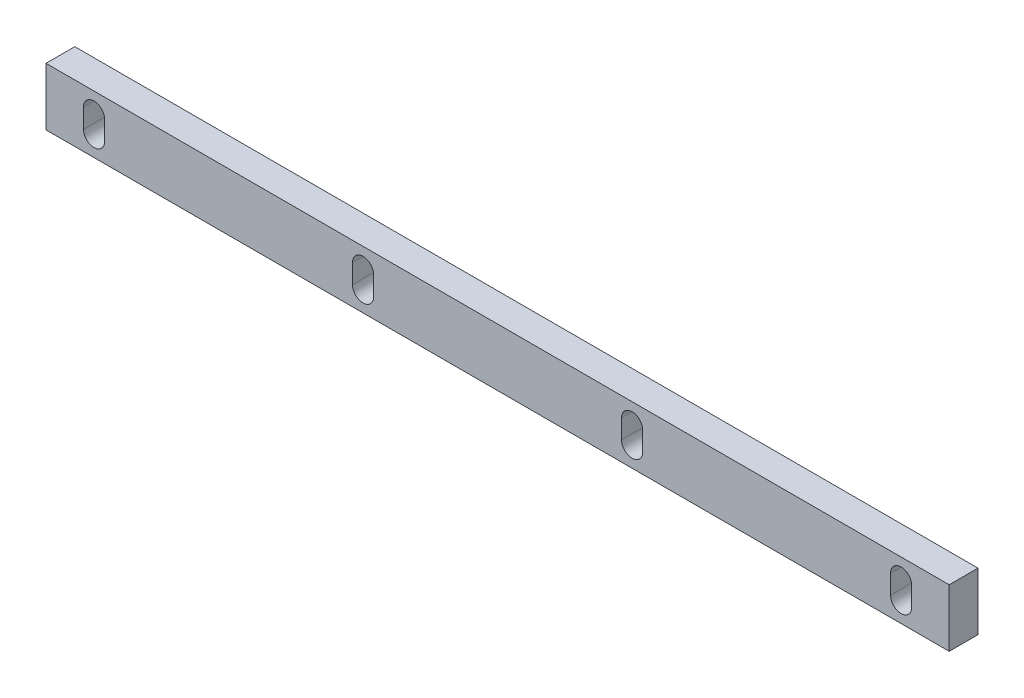
ISO-10303-21;
HEADER;
FILE_DESCRIPTION(('STEP AP214'),'2;1');
FILE_NAME('part.step','',(''),(''),'','','');
FILE_SCHEMA(('AUTOMOTIVE_DESIGN { 1 0 10303 214 1 1 1 1 }'));
ENDSEC;
DATA;
#1=APPLICATION_CONTEXT('core data for automotive mechanical design processes');
#2=APPLICATION_PROTOCOL_DEFINITION('international standard','automotive_design',2000,#1);
#3=PRODUCT_CONTEXT('',#1,'mechanical');
#4=PRODUCT('Part','Part','',(#3));
#5=PRODUCT_RELATED_PRODUCT_CATEGORY('part','',(#4));
#6=PRODUCT_DEFINITION_FORMATION('','',#4);
#7=PRODUCT_DEFINITION_CONTEXT('part definition',#1,'design');
#8=PRODUCT_DEFINITION('design','',#6,#7);
#9=PRODUCT_DEFINITION_SHAPE('','',#8);
#10=(LENGTH_UNIT() NAMED_UNIT(*) SI_UNIT(.MILLI.,.METRE.));
#11=(NAMED_UNIT(*) PLANE_ANGLE_UNIT() SI_UNIT($,.RADIAN.));
#12=(NAMED_UNIT(*) SI_UNIT($,.STERADIAN.) SOLID_ANGLE_UNIT());
#13=UNCERTAINTY_MEASURE_WITH_UNIT(LENGTH_MEASURE(1.E-05),#10,'distance_accuracy_value','');
#14=(GEOMETRIC_REPRESENTATION_CONTEXT(3) GLOBAL_UNCERTAINTY_ASSIGNED_CONTEXT((#13)) GLOBAL_UNIT_ASSIGNED_CONTEXT((#10,
#11,#12)) REPRESENTATION_CONTEXT('',''));
#15=CARTESIAN_POINT('',(0.,0.,0.));
#16=DIRECTION('',(0.,0.,1.));
#17=DIRECTION('',(1.,0.,0.));
#18=AXIS2_PLACEMENT_3D('',#15,#16,#17);
#19=CARTESIAN_POINT('',(235.,-14.9999999999949,7.49999999999917));
#20=DIRECTION('',(0.,1.00000000000003,0.));
#21=DIRECTION('',(0.,0.,1.00000000000003));
#22=AXIS2_PLACEMENT_3D('',#19,#20,#21);
#23=PLANE('',#22);
#24=DIRECTION('',(0.,0.,-1.00000000000003));
#25=VECTOR('',#24,1.);
#26=CARTESIAN_POINT('',(-235.000000000001,-14.9999999999925,7.49999999999906));
#27=LINE('',#26,#25);
#28=CARTESIAN_POINT('',(-235.000000000001,-14.9999999999925,7.49999999999906));
#29=VERTEX_POINT('',#28);
#30=CARTESIAN_POINT('',(-235.,-14.9999999999946,-7.50000000000128));
#31=VERTEX_POINT('',#30);
#32=EDGE_CURVE('E264',#29,#31,#27,.T.);
#33=ORIENTED_EDGE('',*,*,#32,.T.);
#34=DIRECTION('',(-1.,0.,0.));
#35=VECTOR('',#34,1.);
#36=CARTESIAN_POINT('',(235.,-14.9999999999947,-7.50000000000151));
#37=LINE('',#36,#35);
#38=CARTESIAN_POINT('',(235.,-14.9999999999947,-7.50000000000151));
#39=VERTEX_POINT('',#38);
#40=EDGE_CURVE('E291',#39,#31,#37,.T.);
#41=ORIENTED_EDGE('',*,*,#40,.F.);
#42=DIRECTION('',(0.,0.,-1.00000000000003));
#43=VECTOR('',#42,1.);
#44=CARTESIAN_POINT('',(235.,-14.9999999999949,7.49999999999917));
#45=LINE('',#44,#43);
#46=CARTESIAN_POINT('',(235.,-14.9999999999949,7.49999999999917));
#47=VERTEX_POINT('',#46);
#48=EDGE_CURVE('E265',#47,#39,#45,.T.);
#49=ORIENTED_EDGE('',*,*,#48,.F.);
#50=DIRECTION('',(-1.,0.,0.));
#51=VECTOR('',#50,1.);
#52=CARTESIAN_POINT('',(235.,-14.9999999999949,7.49999999999917));
#53=LINE('',#52,#51);
#54=EDGE_CURVE('E275',#47,#29,#53,.T.);
#55=ORIENTED_EDGE('',*,*,#54,.T.);
#56=EDGE_LOOP('',(#33,#41,#49,#55));
#57=FACE_BOUND('',#56,.T.);
#58=ADVANCED_FACE('F52',(#57),#23,.F.);
#59=CARTESIAN_POINT('',(235.,-14.9999999999947,-7.50000000000151));
#60=DIRECTION('',(0.,0.,1.00000000000003));
#61=DIRECTION('',(1.,0.,0.));
#62=AXIS2_PLACEMENT_3D('',#59,#60,#61);
#63=PLANE('',#62);
#64=DIRECTION('',(0.,-1.00000000000003,0.));
#65=VECTOR('',#64,1.);
#66=CARTESIAN_POINT('',(-75.5000000000019,-14.9999999999992,-7.50000000000028));
#67=LINE('',#66,#65);
#68=CARTESIAN_POINT('',(-75.5000000000019,5.00000000000322,-7.50000000000073));
#69=VERTEX_POINT('',#68);
#70=CARTESIAN_POINT('',(-75.5000000000019,-4.99999999999867,-7.49999999999917));
#71=VERTEX_POINT('',#70);
#72=EDGE_CURVE('E224',#69,#71,#67,.T.);
#73=ORIENTED_EDGE('',*,*,#72,.T.);
#74=CARTESIAN_POINT('',(-70.0000000000019,-4.99999999999878,-7.49999999999951));
#75=DIRECTION('',(0.,0.,1.00000000000003));
#76=DIRECTION('',(1.,0.,0.));
#77=AXIS2_PLACEMENT_3D('',#74,#75,#76);
#78=CIRCLE('',#77,5.50000000000001);
#79=CARTESIAN_POINT('',(-64.500000000002,-4.99999999999945,-7.49999999999995));
#80=VERTEX_POINT('',#79);
#81=EDGE_CURVE('E229',#71,#80,#78,.T.);
#82=ORIENTED_EDGE('',*,*,#81,.T.);
#83=DIRECTION('',(0.,1.00000000000003,0.));
#84=VECTOR('',#83,1.);
#85=CARTESIAN_POINT('',(-64.5000000000019,-14.9999999999993,-7.50000000000051));
#86=LINE('',#85,#84);
#87=CARTESIAN_POINT('',(-64.5000000000019,5.000000000003,-7.50000000000095));
#88=VERTEX_POINT('',#87);
#89=EDGE_CURVE('E201',#80,#88,#86,.T.);
#90=ORIENTED_EDGE('',*,*,#89,.T.);
#91=CARTESIAN_POINT('',(-70.0000000000019,5.00000000000278,-7.50000000000084));
#92=DIRECTION('',(0.,0.,1.00000000000003));
#93=DIRECTION('',(1.,0.,0.));
#94=AXIS2_PLACEMENT_3D('',#91,#92,#93);
#95=CIRCLE('',#94,5.50000000000001);
#96=EDGE_CURVE('E208',#88,#69,#95,.T.);
#97=ORIENTED_EDGE('',*,*,#96,.T.);
#98=EDGE_LOOP('',(#73,#82,#90,#97));
#99=FACE_BOUND('',#98,.T.);
#100=DIRECTION('',(0.,-1.00000000000003,0.));
#101=VECTOR('',#100,1.);
#102=CARTESIAN_POINT('',(-215.5,-14.9999999999945,-7.50000000000106));
#103=LINE('',#102,#101);
#104=CARTESIAN_POINT('',(-215.5,5.00000000001055,-7.50000000000106));
#105=VERTEX_POINT('',#104);
#106=CARTESIAN_POINT('',(-215.5,-4.99999999999368,-7.50000000000062));
#107=VERTEX_POINT('',#106);
#108=EDGE_CURVE('E258',#105,#107,#103,.T.);
#109=ORIENTED_EDGE('',*,*,#108,.T.);
#110=CARTESIAN_POINT('',(-210.,-4.99999999999379,-7.50000000000017));
#111=DIRECTION('',(0.,0.,1.00000000000003));
#112=DIRECTION('',(1.,0.,0.));
#113=AXIS2_PLACEMENT_3D('',#110,#111,#112);
#114=CIRCLE('',#113,5.50000000000001);
#115=CARTESIAN_POINT('',(-204.5,-4.99999999999345,-7.50000000000062));
#116=VERTEX_POINT('',#115);
#117=EDGE_CURVE('E261',#107,#116,#114,.T.);
#118=ORIENTED_EDGE('',*,*,#117,.T.);
#119=DIRECTION('',(0.,1.00000000000003,0.));
#120=VECTOR('',#119,1.);
#121=CARTESIAN_POINT('',(-204.5,-14.999999999993,-7.50000000000117));
#122=LINE('',#121,#120);
#123=CARTESIAN_POINT('',(-204.5,5.00000000001,-7.50000000000139));
#124=VERTEX_POINT('',#123);
#125=EDGE_CURVE('E246',#116,#124,#122,.T.);
#126=ORIENTED_EDGE('',*,*,#125,.T.);
#127=CARTESIAN_POINT('',(-210.,5.000000000009,-7.50000000000139));
#128=DIRECTION('',(0.,0.,1.00000000000003));
#129=DIRECTION('',(1.,0.,0.));
#130=AXIS2_PLACEMENT_3D('',#127,#128,#129);
#131=CIRCLE('',#130,5.50000000000001);
#132=EDGE_CURVE('E255',#124,#105,#131,.T.);
#133=ORIENTED_EDGE('',*,*,#132,.T.);
#134=EDGE_LOOP('',(#109,#118,#126,#133));
#135=FACE_BOUND('',#134,.T.);
#136=DIRECTION('',(0.,1.00000000000003,0.));
#137=VECTOR('',#136,1.);
#138=CARTESIAN_POINT('',(-235.,-14.9999999999946,-7.50000000000128));
#139=LINE('',#138,#137);
#140=CARTESIAN_POINT('',(-235.,15.0000000000025,-7.49999999999917));
#141=VERTEX_POINT('',#140);
#142=EDGE_CURVE('E278',#31,#141,#139,.T.);
#143=ORIENTED_EDGE('',*,*,#142,.T.);
#144=DIRECTION('',(-1.,0.,0.));
#145=VECTOR('',#144,1.);
#146=CARTESIAN_POINT('',(235.,15.0000000000019,-7.49999999999929));
#147=LINE('',#146,#145);
#148=CARTESIAN_POINT('',(235.,15.0000000000019,-7.49999999999929));
#149=VERTEX_POINT('',#148);
#150=EDGE_CURVE('E288',#149,#141,#147,.T.);
#151=ORIENTED_EDGE('',*,*,#150,.F.);
#152=DIRECTION('',(0.,1.00000000000003,0.));
#153=VECTOR('',#152,1.);
#154=CARTESIAN_POINT('',(235.,-14.9999999999947,-7.50000000000151));
#155=LINE('',#154,#153);
#156=EDGE_CURVE('E268',#39,#149,#155,.T.);
#157=ORIENTED_EDGE('',*,*,#156,.F.);
#158=ORIENTED_EDGE('',*,*,#40,.T.);
#159=EDGE_LOOP('',(#143,#151,#157,#158));
#160=FACE_BOUND('',#159,.T.);
#161=CARTESIAN_POINT('',(69.999999999998,-4.9999999999979,-7.4999999999984));
#162=DIRECTION('',(0.,0.,1.00000000000003));
#163=DIRECTION('',(1.,0.,0.));
#164=AXIS2_PLACEMENT_3D('',#161,#162,#163);
#165=CIRCLE('',#164,5.50000000000001);
#166=CARTESIAN_POINT('',(64.499999999998,-4.99999999999645,-7.49999999999873));
#167=VERTEX_POINT('',#166);
#168=CARTESIAN_POINT('',(75.499999999998,-4.99999999999712,-7.50000000000151));
#169=VERTEX_POINT('',#168);
#170=EDGE_CURVE('E305',#167,#169,#165,.T.);
#171=ORIENTED_EDGE('',*,*,#170,.T.);
#172=DIRECTION('',(0.,1.00000000000003,0.));
#173=VECTOR('',#172,1.);
#174=CARTESIAN_POINT('',(75.499999999998,-14.9999999999978,-7.50000000000173));
#175=LINE('',#174,#173);
#176=CARTESIAN_POINT('',(75.499999999998,5.000000000005,-7.50000000000217));
#177=VERTEX_POINT('',#176);
#178=EDGE_CURVE('E307',#169,#177,#175,.T.);
#179=ORIENTED_EDGE('',*,*,#178,.T.);
#180=CARTESIAN_POINT('',(69.999999999998,5.000000000005,-7.50000000000217));
#181=DIRECTION('',(0.,0.,1.00000000000003));
#182=DIRECTION('',(1.,0.,0.));
#183=AXIS2_PLACEMENT_3D('',#180,#181,#182);
#184=CIRCLE('',#183,5.50000000000001);
#185=CARTESIAN_POINT('',(64.499999999998,5.000000000006,-7.50000000000162));
#186=VERTEX_POINT('',#185);
#187=EDGE_CURVE('E309',#177,#186,#184,.T.);
#188=ORIENTED_EDGE('',*,*,#187,.T.);
#189=DIRECTION('',(0.,-1.00000000000003,0.));
#190=VECTOR('',#189,1.);
#191=CARTESIAN_POINT('',(64.499999999998,-14.9999999999944,-7.50000000000162));
#192=LINE('',#191,#190);
#193=EDGE_CURVE('E311',#186,#167,#192,.T.);
#194=ORIENTED_EDGE('',*,*,#193,.T.);
#195=EDGE_LOOP('',(#171,#179,#188,#194));
#196=FACE_BOUND('',#195,.T.);
#197=CARTESIAN_POINT('',(210.,-4.99999999999701,-7.4999999999994));
#198=DIRECTION('',(0.,0.,1.00000000000003));
#199=DIRECTION('',(1.,0.,0.));
#200=AXIS2_PLACEMENT_3D('',#197,#198,#199);
#201=CIRCLE('',#200,5.50000000000001);
#202=CARTESIAN_POINT('',(204.5,-4.99999999999701,-7.49999999999895));
#203=VERTEX_POINT('',#202);
#204=CARTESIAN_POINT('',(215.5,-4.9999999999969,-7.49999999999917));
#205=VERTEX_POINT('',#204);
#206=EDGE_CURVE('E67',#203,#205,#201,.T.);
#207=ORIENTED_EDGE('',*,*,#206,.T.);
#208=DIRECTION('',(0.,1.00000000000003,0.));
#209=VECTOR('',#208,1.);
#210=CARTESIAN_POINT('',(215.5,-14.9999999999949,-7.50000000000195));
#211=LINE('',#210,#209);
#212=CARTESIAN_POINT('',(215.5,5.00000000000633,-7.50000000000073));
#213=VERTEX_POINT('',#212);
#214=EDGE_CURVE('E338',#205,#213,#211,.T.);
#215=ORIENTED_EDGE('',*,*,#214,.T.);
#216=CARTESIAN_POINT('',(210.,5.00000000000533,-7.50000000000195));
#217=DIRECTION('',(0.,0.,1.00000000000003));
#218=DIRECTION('',(1.,0.,0.));
#219=AXIS2_PLACEMENT_3D('',#216,#217,#218);
#220=CIRCLE('',#219,5.50000000000001);
#221=CARTESIAN_POINT('',(204.5,5.00000000000644,-7.50000000000228));
#222=VERTEX_POINT('',#221);
#223=EDGE_CURVE('E74',#213,#222,#220,.T.);
#224=ORIENTED_EDGE('',*,*,#223,.T.);
#225=DIRECTION('',(0.,-1.00000000000003,0.));
#226=VECTOR('',#225,1.);
#227=CARTESIAN_POINT('',(204.5,-14.9999999999948,-7.50000000000206));
#228=LINE('',#227,#226);
#229=EDGE_CURVE('E341',#222,#203,#228,.T.);
#230=ORIENTED_EDGE('',*,*,#229,.T.);
#231=EDGE_LOOP('',(#207,#215,#224,#230));
#232=FACE_BOUND('',#231,.T.);
#233=ADVANCED_FACE('F368',(#99,#135,#160,#196,#232),#63,.F.);
#234=CARTESIAN_POINT('',(235.,15.0000000000017,7.5000000000004));
#235=DIRECTION('',(0.,-1.00000000000003,0.));
#236=DIRECTION('',(0.,0.,-1.00000000000003));
#237=AXIS2_PLACEMENT_3D('',#234,#235,#236);
#238=PLANE('',#237);
#239=DIRECTION('',(0.,0.,1.00000000000003));
#240=VECTOR('',#239,1.);
#241=CARTESIAN_POINT('',(-235.000000000001,15.0000000000021,7.49999999999995));
#242=LINE('',#241,#240);
#243=CARTESIAN_POINT('',(-235.000000000001,15.0000000000021,7.49999999999995));
#244=VERTEX_POINT('',#243);
#245=EDGE_CURVE('E280',#141,#244,#242,.T.);
#246=ORIENTED_EDGE('',*,*,#245,.T.);
#247=DIRECTION('',(-1.,0.,0.));
#248=VECTOR('',#247,1.);
#249=CARTESIAN_POINT('',(235.,15.0000000000017,7.5000000000004));
#250=LINE('',#249,#248);
#251=CARTESIAN_POINT('',(235.,15.0000000000017,7.5000000000004));
#252=VERTEX_POINT('',#251);
#253=EDGE_CURVE('E285',#252,#244,#250,.T.);
#254=ORIENTED_EDGE('',*,*,#253,.F.);
#255=DIRECTION('',(0.,0.,1.00000000000003));
#256=VECTOR('',#255,1.);
#257=CARTESIAN_POINT('',(235.,15.0000000000017,7.5000000000004));
#258=LINE('',#257,#256);
#259=EDGE_CURVE('E271',#149,#252,#258,.T.);
#260=ORIENTED_EDGE('',*,*,#259,.F.);
#261=ORIENTED_EDGE('',*,*,#150,.T.);
#262=EDGE_LOOP('',(#246,#254,#260,#261));
#263=FACE_BOUND('',#262,.T.);
#264=ADVANCED_FACE('F374',(#263),#238,.F.);
#265=CARTESIAN_POINT('',(235.,-14.9999999999949,7.49999999999917));
#266=DIRECTION('',(0.,0.,-1.00000000000003));
#267=DIRECTION('',(-1.,0.,0.));
#268=AXIS2_PLACEMENT_3D('',#265,#266,#267);
#269=PLANE('',#268);
#270=DIRECTION('',(0.,1.00000000000003,0.));
#271=VECTOR('',#270,1.);
#272=CARTESIAN_POINT('',(-64.4999999999999,5.00000000000012,7.50000000000284));
#273=LINE('',#272,#271);
#274=CARTESIAN_POINT('',(-64.4999999999999,-5.00000000000156,7.50000000000106));
#275=VERTEX_POINT('',#274);
#276=CARTESIAN_POINT('',(-64.4999999999999,5.00000000000012,7.50000000000284));
#277=VERTEX_POINT('',#276);
#278=EDGE_CURVE('E191',#275,#277,#273,.T.);
#279=ORIENTED_EDGE('',*,*,#278,.F.);
#280=CARTESIAN_POINT('',(-70.,-4.99999999999878,7.50000000000239));
#281=DIRECTION('',(0.,0.,1.00000000000003));
#282=DIRECTION('',(-1.,0.,0.));
#283=AXIS2_PLACEMENT_3D('',#280,#281,#282);
#284=CIRCLE('',#283,5.50000000000001);
#285=CARTESIAN_POINT('',(-75.5,-4.99999999999845,7.50000000000006));
#286=VERTEX_POINT('',#285);
#287=EDGE_CURVE('E227',#286,#275,#284,.T.);
#288=ORIENTED_EDGE('',*,*,#287,.F.);
#289=DIRECTION('',(0.,-1.00000000000003,0.));
#290=VECTOR('',#289,1.);
#291=CARTESIAN_POINT('',(-75.5,-4.99999999999845,7.50000000000006));
#292=LINE('',#291,#290);
#293=CARTESIAN_POINT('',(-75.4999999999999,5.00000000000034,7.50000000000217));
#294=VERTEX_POINT('',#293);
#295=EDGE_CURVE('E213',#294,#286,#292,.T.);
#296=ORIENTED_EDGE('',*,*,#295,.F.);
#297=CARTESIAN_POINT('',(-70.,5.00000000000078,7.50000000000128));
#298=DIRECTION('',(0.,0.,1.00000000000003));
#299=DIRECTION('',(-1.,0.,0.));
#300=AXIS2_PLACEMENT_3D('',#297,#298,#299);
#301=CIRCLE('',#300,5.50000000000001);
#302=EDGE_CURVE('E205',#277,#294,#301,.T.);
#303=ORIENTED_EDGE('',*,*,#302,.F.);
#304=EDGE_LOOP('',(#279,#288,#296,#303));
#305=FACE_BOUND('',#304,.T.);
#306=DIRECTION('',(0.,1.00000000000003,0.));
#307=VECTOR('',#306,1.);
#308=CARTESIAN_POINT('',(-204.500000000001,5.00000000000256,7.49999999999884));
#309=LINE('',#308,#307);
#310=CARTESIAN_POINT('',(-204.500000000001,-4.99999999999567,7.50000000000017));
#311=VERTEX_POINT('',#310);
#312=CARTESIAN_POINT('',(-204.500000000001,5.00000000000256,7.49999999999884));
#313=VERTEX_POINT('',#312);
#314=EDGE_CURVE('E234',#311,#313,#309,.T.);
#315=ORIENTED_EDGE('',*,*,#314,.F.);
#316=CARTESIAN_POINT('',(-210.000000000001,-4.99999999999312,7.50000000000095));
#317=DIRECTION('',(0.,0.,1.00000000000003));
#318=DIRECTION('',(-1.,0.,0.));
#319=AXIS2_PLACEMENT_3D('',#316,#317,#318);
#320=CIRCLE('',#319,5.50000000000001);
#321=CARTESIAN_POINT('',(-215.500000000001,-4.99999999999312,7.50000000000073));
#322=VERTEX_POINT('',#321);
#323=EDGE_CURVE('E232',#322,#311,#320,.T.);
#324=ORIENTED_EDGE('',*,*,#323,.F.);
#325=DIRECTION('',(0.,-1.00000000000003,0.));
#326=VECTOR('',#325,1.);
#327=CARTESIAN_POINT('',(-215.500000000001,-4.99999999999312,7.50000000000073));
#328=LINE('',#327,#326);
#329=CARTESIAN_POINT('',(-215.500000000001,5.00000000000778,7.49999999999984));
#330=VERTEX_POINT('',#329);
#331=EDGE_CURVE('E240',#330,#322,#328,.T.);
#332=ORIENTED_EDGE('',*,*,#331,.F.);
#333=CARTESIAN_POINT('',(-210.000000000001,5.00000000000722,7.49999999999995));
#334=DIRECTION('',(0.,0.,1.00000000000003));
#335=DIRECTION('',(-1.,0.,0.));
#336=AXIS2_PLACEMENT_3D('',#333,#334,#335);
#337=CIRCLE('',#336,5.50000000000001);
#338=EDGE_CURVE('E237',#313,#330,#337,.T.);
#339=ORIENTED_EDGE('',*,*,#338,.F.);
#340=EDGE_LOOP('',(#315,#324,#332,#339));
#341=FACE_BOUND('',#340,.T.);
#342=DIRECTION('',(0.,-1.00000000000003,0.));
#343=VECTOR('',#342,1.);
#344=CARTESIAN_POINT('',(-235.000000000001,-14.9999999999925,7.49999999999906));
#345=LINE('',#344,#343);
#346=EDGE_CURVE('E269',#244,#29,#345,.T.);
#347=ORIENTED_EDGE('',*,*,#346,.T.);
#348=ORIENTED_EDGE('',*,*,#54,.F.);
#349=DIRECTION('',(0.,-1.00000000000003,0.));
#350=VECTOR('',#349,1.);
#351=CARTESIAN_POINT('',(235.,-14.9999999999949,7.49999999999917));
#352=LINE('',#351,#350);
#353=EDGE_CURVE('E273',#252,#47,#352,.T.);
#354=ORIENTED_EDGE('',*,*,#353,.F.);
#355=ORIENTED_EDGE('',*,*,#253,.T.);
#356=EDGE_LOOP('',(#347,#348,#354,#355));
#357=FACE_BOUND('',#356,.T.);
#358=CARTESIAN_POINT('',(69.9999999999999,-4.99999999999745,7.5000000000035));
#359=DIRECTION('',(0.,0.,1.00000000000003));
#360=DIRECTION('',(-1.,0.,0.));
#361=AXIS2_PLACEMENT_3D('',#358,#359,#360);
#362=CIRCLE('',#361,5.50000000000001);
#363=CARTESIAN_POINT('',(64.4999999999998,-4.99999999999545,7.50000000000239));
#364=VERTEX_POINT('',#363);
#365=CARTESIAN_POINT('',(75.4999999999998,-4.9999999999979,7.50000000000295));
#366=VERTEX_POINT('',#365);
#367=EDGE_CURVE('E294',#364,#366,#362,.T.);
#368=ORIENTED_EDGE('',*,*,#367,.F.);
#369=DIRECTION('',(0.,-1.00000000000003,0.));
#370=VECTOR('',#369,1.);
#371=CARTESIAN_POINT('',(64.4999999999998,-4.99999999999545,7.50000000000239));
#372=LINE('',#371,#370);
#373=CARTESIAN_POINT('',(64.5000000000001,5.00000000000378,7.5000000000004));
#374=VERTEX_POINT('',#373);
#375=EDGE_CURVE('E296',#374,#364,#372,.T.);
#376=ORIENTED_EDGE('',*,*,#375,.F.);
#377=CARTESIAN_POINT('',(70.,5.00000000000533,7.50000000000062));
#378=DIRECTION('',(0.,0.,1.00000000000003));
#379=DIRECTION('',(-1.,0.,0.));
#380=AXIS2_PLACEMENT_3D('',#377,#378,#379);
#381=CIRCLE('',#380,5.50000000000001);
#382=CARTESIAN_POINT('',(75.5,5.00000000000445,7.50000000000028));
#383=VERTEX_POINT('',#382);
#384=EDGE_CURVE('E299',#383,#374,#381,.T.);
#385=ORIENTED_EDGE('',*,*,#384,.F.);
#386=DIRECTION('',(0.,1.00000000000003,0.));
#387=VECTOR('',#386,1.);
#388=CARTESIAN_POINT('',(75.5,5.00000000000445,7.50000000000028));
#389=LINE('',#388,#387);
#390=EDGE_CURVE('E302',#366,#383,#389,.T.);
#391=ORIENTED_EDGE('',*,*,#390,.F.);
#392=EDGE_LOOP('',(#368,#376,#385,#391));
#393=FACE_BOUND('',#392,.T.);
#394=CARTESIAN_POINT('',(210.,-4.9999999999979,7.50000000000062));
#395=DIRECTION('',(0.,0.,1.00000000000003));
#396=DIRECTION('',(-1.,0.,0.));
#397=AXIS2_PLACEMENT_3D('',#394,#395,#396);
#398=CIRCLE('',#397,5.50000000000001);
#399=CARTESIAN_POINT('',(204.5,-4.99999999999756,7.50000000000051));
#400=VERTEX_POINT('',#399);
#401=CARTESIAN_POINT('',(215.5,-4.9999999999979,7.5000000000004));
#402=VERTEX_POINT('',#401);
#403=EDGE_CURVE('E326',#400,#402,#398,.T.);
#404=ORIENTED_EDGE('',*,*,#403,.F.);
#405=DIRECTION('',(0.,-1.00000000000003,0.));
#406=VECTOR('',#405,1.);
#407=CARTESIAN_POINT('',(204.5,-4.99999999999756,7.50000000000051));
#408=LINE('',#407,#406);
#409=CARTESIAN_POINT('',(204.5,5.00000000000467,7.49999999999984));
#410=VERTEX_POINT('',#409);
#411=EDGE_CURVE('E328',#410,#400,#408,.T.);
#412=ORIENTED_EDGE('',*,*,#411,.F.);
#413=CARTESIAN_POINT('',(210.,5.00000000000322,7.4999999999994));
#414=DIRECTION('',(0.,0.,1.00000000000003));
#415=DIRECTION('',(-1.,0.,0.));
#416=AXIS2_PLACEMENT_3D('',#413,#414,#415);
#417=CIRCLE('',#416,5.50000000000001);
#418=CARTESIAN_POINT('',(215.5,5.00000000000489,7.49999999999951));
#419=VERTEX_POINT('',#418);
#420=EDGE_CURVE('E331',#419,#410,#417,.T.);
#421=ORIENTED_EDGE('',*,*,#420,.F.);
#422=DIRECTION('',(0.,1.00000000000003,0.));
#423=VECTOR('',#422,1.);
#424=CARTESIAN_POINT('',(215.5,5.00000000000489,7.49999999999951));
#425=LINE('',#424,#423);
#426=EDGE_CURVE('E334',#402,#419,#425,.T.);
#427=ORIENTED_EDGE('',*,*,#426,.F.);
#428=EDGE_LOOP('',(#404,#412,#421,#427));
#429=FACE_BOUND('',#428,.T.);
#430=ADVANCED_FACE('F211',(#305,#341,#357,#393,#429),#269,.F.);
#431=CARTESIAN_POINT('',(235.,-14.9999999999947,-7.50000000000151));
#432=DIRECTION('',(1.,0.,0.));
#433=DIRECTION('',(0.,0.,-1.00000000000003));
#434=AXIS2_PLACEMENT_3D('',#431,#432,#433);
#435=PLANE('',#434);
#436=ORIENTED_EDGE('',*,*,#48,.T.);
#437=ORIENTED_EDGE('',*,*,#156,.T.);
#438=ORIENTED_EDGE('',*,*,#259,.T.);
#439=ORIENTED_EDGE('',*,*,#353,.T.);
#440=EDGE_LOOP('',(#436,#437,#438,#439));
#441=FACE_BOUND('',#440,.T.);
#442=ADVANCED_FACE('F408',(#441),#435,.T.);
#443=CARTESIAN_POINT('',(-235.,-14.9999999999946,-7.50000000000128));
#444=DIRECTION('',(1.,0.,0.));
#445=DIRECTION('',(0.,0.,-1.00000000000003));
#446=AXIS2_PLACEMENT_3D('',#443,#444,#445);
#447=PLANE('',#446);
#448=ORIENTED_EDGE('',*,*,#32,.F.);
#449=ORIENTED_EDGE('',*,*,#346,.F.);
#450=ORIENTED_EDGE('',*,*,#245,.F.);
#451=ORIENTED_EDGE('',*,*,#142,.F.);
#452=EDGE_LOOP('',(#448,#449,#450,#451));
#453=FACE_BOUND('',#452,.T.);
#454=ADVANCED_FACE('F414',(#453),#447,.F.);
#455=CARTESIAN_POINT('',(-210.,-4.99999999999434,-12.4999999999987));
#456=DIRECTION('',(0.,0.,1.00000000000003));
#457=DIRECTION('',(1.,0.,0.));
#458=AXIS2_PLACEMENT_3D('',#455,#456,#457);
#459=CYLINDRICAL_SURFACE('',#458,5.50000000000001);
#460=DIRECTION('',(0.,0.,1.00000000000003));
#461=VECTOR('',#460,1.);
#462=CARTESIAN_POINT('',(-215.5,-4.99999999999423,-12.4999999999985));
#463=LINE('',#462,#461);
#464=EDGE_CURVE('E244',#107,#322,#463,.T.);
#465=ORIENTED_EDGE('',*,*,#464,.T.);
#466=ORIENTED_EDGE('',*,*,#323,.T.);
#467=DIRECTION('',(0.,0.,1.00000000000003));
#468=VECTOR('',#467,1.);
#469=CARTESIAN_POINT('',(-204.5,-4.99999999999423,-12.4999999999986));
#470=LINE('',#469,#468);
#471=EDGE_CURVE('E243',#116,#311,#470,.T.);
#472=ORIENTED_EDGE('',*,*,#471,.F.);
#473=ORIENTED_EDGE('',*,*,#117,.F.);
#474=EDGE_LOOP('',(#465,#466,#472,#473));
#475=FACE_BOUND('',#474,.T.);
#476=ADVANCED_FACE('F420',(#475),#459,.F.);
#477=CARTESIAN_POINT('',(-215.5,-4.99999999999423,-12.4999999999985));
#478=DIRECTION('',(-1.,0.,0.));
#479=DIRECTION('',(0.,0.,1.00000000000003));
#480=AXIS2_PLACEMENT_3D('',#477,#478,#479);
#481=PLANE('',#480);
#482=DIRECTION('',(0.,0.,1.00000000000003));
#483=VECTOR('',#482,1.);
#484=CARTESIAN_POINT('',(-215.5,5.00000000000766,-12.4999999999978));
#485=LINE('',#484,#483);
#486=EDGE_CURVE('E247',#105,#330,#485,.T.);
#487=ORIENTED_EDGE('',*,*,#486,.T.);
#488=ORIENTED_EDGE('',*,*,#331,.T.);
#489=ORIENTED_EDGE('',*,*,#464,.F.);
#490=ORIENTED_EDGE('',*,*,#108,.F.);
#491=EDGE_LOOP('',(#487,#488,#489,#490));
#492=FACE_BOUND('',#491,.T.);
#493=ADVANCED_FACE('F425',(#492),#481,.F.);
#494=CARTESIAN_POINT('',(-210.,5.00000000000811,-12.4999999999975));
#495=DIRECTION('',(0.,0.,1.00000000000003));
#496=DIRECTION('',(1.,0.,0.));
#497=AXIS2_PLACEMENT_3D('',#494,#495,#496);
#498=CYLINDRICAL_SURFACE('',#497,5.50000000000001);
#499=DIRECTION('',(0.,0.,1.00000000000003));
#500=VECTOR('',#499,1.);
#501=CARTESIAN_POINT('',(-204.5,5.000000000009,-12.4999999999974));
#502=LINE('',#501,#500);
#503=EDGE_CURVE('E249',#124,#313,#502,.T.);
#504=ORIENTED_EDGE('',*,*,#503,.T.);
#505=ORIENTED_EDGE('',*,*,#338,.T.);
#506=ORIENTED_EDGE('',*,*,#486,.F.);
#507=ORIENTED_EDGE('',*,*,#132,.F.);
#508=EDGE_LOOP('',(#504,#505,#506,#507));
#509=FACE_BOUND('',#508,.T.);
#510=ADVANCED_FACE('F431',(#509),#498,.F.);
#511=CARTESIAN_POINT('',(-204.5,5.000000000009,-12.4999999999974));
#512=DIRECTION('',(1.,0.,0.));
#513=DIRECTION('',(0.,0.,-1.00000000000003));
#514=AXIS2_PLACEMENT_3D('',#511,#512,#513);
#515=PLANE('',#514);
#516=ORIENTED_EDGE('',*,*,#471,.T.);
#517=ORIENTED_EDGE('',*,*,#314,.T.);
#518=ORIENTED_EDGE('',*,*,#503,.F.);
#519=ORIENTED_EDGE('',*,*,#125,.F.);
#520=EDGE_LOOP('',(#516,#517,#518,#519));
#521=FACE_BOUND('',#520,.T.);
#522=ADVANCED_FACE('F427',(#521),#515,.F.);
#523=CARTESIAN_POINT('',(-70.0000000000019,-5.00000000000056,-12.4999999999974));
#524=DIRECTION('',(0.,0.,1.00000000000003));
#525=DIRECTION('',(1.,0.,0.));
#526=AXIS2_PLACEMENT_3D('',#523,#524,#525);
#527=CYLINDRICAL_SURFACE('',#526,5.50000000000001);
#528=DIRECTION('',(0.,0.,1.00000000000003));
#529=VECTOR('',#528,1.);
#530=CARTESIAN_POINT('',(-75.5000000000019,-4.99999999999889,-12.5000000000005));
#531=LINE('',#530,#529);
#532=EDGE_CURVE('E221',#71,#286,#531,.T.);
#533=ORIENTED_EDGE('',*,*,#532,.T.);
#534=ORIENTED_EDGE('',*,*,#287,.T.);
#535=DIRECTION('',(0.,0.,1.00000000000003));
#536=VECTOR('',#535,1.);
#537=CARTESIAN_POINT('',(-64.5000000000019,-5.00000000000023,-12.4999999999971));
#538=LINE('',#537,#536);
#539=EDGE_CURVE('E197',#80,#275,#538,.T.);
#540=ORIENTED_EDGE('',*,*,#539,.F.);
#541=ORIENTED_EDGE('',*,*,#81,.F.);
#542=EDGE_LOOP('',(#533,#534,#540,#541));
#543=FACE_BOUND('',#542,.T.);
#544=ADVANCED_FACE('F430',(#543),#527,.F.);
#545=CARTESIAN_POINT('',(-75.5000000000019,-4.99999999999889,-12.5000000000005));
#546=DIRECTION('',(-1.,0.,0.));
#547=DIRECTION('',(0.,0.,1.00000000000003));
#548=AXIS2_PLACEMENT_3D('',#545,#546,#547);
#549=PLANE('',#548);
#550=DIRECTION('',(0.,0.,1.00000000000003));
#551=VECTOR('',#550,1.);
#552=CARTESIAN_POINT('',(-75.4999999999999,5.00000000000189,-12.4999999999996));
#553=LINE('',#552,#551);
#554=EDGE_CURVE('E214',#69,#294,#553,.T.);
#555=ORIENTED_EDGE('',*,*,#554,.T.);
#556=ORIENTED_EDGE('',*,*,#295,.T.);
#557=ORIENTED_EDGE('',*,*,#532,.F.);
#558=ORIENTED_EDGE('',*,*,#72,.F.);
#559=EDGE_LOOP('',(#555,#556,#557,#558));
#560=FACE_BOUND('',#559,.T.);
#561=ADVANCED_FACE('F441',(#560),#549,.F.);
#562=CARTESIAN_POINT('',(-69.9999999999999,5.00000000000245,-12.5));
#563=DIRECTION('',(0.,0.,1.00000000000003));
#564=DIRECTION('',(1.,0.,0.));
#565=AXIS2_PLACEMENT_3D('',#562,#563,#564);
#566=CYLINDRICAL_SURFACE('',#565,5.50000000000001);
#567=DIRECTION('',(0.,0.,1.00000000000003));
#568=VECTOR('',#567,1.);
#569=CARTESIAN_POINT('',(-64.4999999999999,5.00000000000189,-12.5));
#570=LINE('',#569,#568);
#571=EDGE_CURVE('E194',#88,#277,#570,.T.);
#572=ORIENTED_EDGE('',*,*,#571,.T.);
#573=ORIENTED_EDGE('',*,*,#302,.T.);
#574=ORIENTED_EDGE('',*,*,#554,.F.);
#575=ORIENTED_EDGE('',*,*,#96,.F.);
#576=EDGE_LOOP('',(#572,#573,#574,#575));
#577=FACE_BOUND('',#576,.T.);
#578=ADVANCED_FACE('F204',(#577),#566,.F.);
#579=CARTESIAN_POINT('',(-64.4999999999999,5.00000000000189,-12.5));
#580=DIRECTION('',(1.,0.,0.));
#581=DIRECTION('',(0.,0.,-1.00000000000003));
#582=AXIS2_PLACEMENT_3D('',#579,#580,#581);
#583=PLANE('',#582);
#584=ORIENTED_EDGE('',*,*,#539,.T.);
#585=ORIENTED_EDGE('',*,*,#278,.T.);
#586=ORIENTED_EDGE('',*,*,#571,.F.);
#587=ORIENTED_EDGE('',*,*,#89,.F.);
#588=EDGE_LOOP('',(#584,#585,#586,#587));
#589=FACE_BOUND('',#588,.T.);
#590=ADVANCED_FACE('F193',(#589),#583,.F.);
#591=CARTESIAN_POINT('',(75.5000000000001,5.00000000000245,-12.5000000000004));
#592=DIRECTION('',(1.,0.,0.));
#593=DIRECTION('',(0.,0.,-1.00000000000003));
#594=AXIS2_PLACEMENT_3D('',#591,#592,#593);
#595=PLANE('',#594);
#596=DIRECTION('',(0.,0.,1.00000000000003));
#597=VECTOR('',#596,1.);
#598=CARTESIAN_POINT('',(75.499999999998,-4.99999999999656,-12.4999999999974));
#599=LINE('',#598,#597);
#600=EDGE_CURVE('E317',#169,#366,#599,.T.);
#601=ORIENTED_EDGE('',*,*,#600,.T.);
#602=ORIENTED_EDGE('',*,*,#390,.T.);
#603=DIRECTION('',(0.,0.,1.00000000000003));
#604=VECTOR('',#603,1.);
#605=CARTESIAN_POINT('',(75.5000000000001,5.00000000000245,-12.5000000000004));
#606=LINE('',#605,#604);
#607=EDGE_CURVE('E323',#177,#383,#606,.T.);
#608=ORIENTED_EDGE('',*,*,#607,.F.);
#609=ORIENTED_EDGE('',*,*,#178,.F.);
#610=EDGE_LOOP('',(#601,#602,#608,#609));
#611=FACE_BOUND('',#610,.T.);
#612=ADVANCED_FACE('F389',(#611),#595,.F.);
#613=CARTESIAN_POINT('',(70.0000000000001,5.00000000000367,-12.4999999999993));
#614=DIRECTION('',(0.,0.,1.00000000000003));
#615=DIRECTION('',(1.,0.,0.));
#616=AXIS2_PLACEMENT_3D('',#613,#614,#615);
#617=CYLINDRICAL_SURFACE('',#616,5.50000000000001);
#618=ORIENTED_EDGE('',*,*,#607,.T.);
#619=ORIENTED_EDGE('',*,*,#384,.T.);
#620=DIRECTION('',(0.,0.,1.00000000000003));
#621=VECTOR('',#620,1.);
#622=CARTESIAN_POINT('',(64.5000000000001,5.000000000002,-12.4999999999997));
#623=LINE('',#622,#621);
#624=EDGE_CURVE('E320',#186,#374,#623,.T.);
#625=ORIENTED_EDGE('',*,*,#624,.F.);
#626=ORIENTED_EDGE('',*,*,#187,.F.);
#627=EDGE_LOOP('',(#618,#619,#625,#626));
#628=FACE_BOUND('',#627,.T.);
#629=ADVANCED_FACE('F386',(#628),#617,.F.);
#630=CARTESIAN_POINT('',(64.499999999998,-4.99999999999712,-12.4999999999995));
#631=DIRECTION('',(-1.,0.,0.));
#632=DIRECTION('',(0.,0.,1.00000000000003));
#633=AXIS2_PLACEMENT_3D('',#630,#631,#632);
#634=PLANE('',#633);
#635=ORIENTED_EDGE('',*,*,#624,.T.);
#636=ORIENTED_EDGE('',*,*,#375,.T.);
#637=DIRECTION('',(0.,0.,1.00000000000003));
#638=VECTOR('',#637,1.);
#639=CARTESIAN_POINT('',(64.499999999998,-4.99999999999712,-12.4999999999995));
#640=LINE('',#639,#638);
#641=EDGE_CURVE('E314',#167,#364,#640,.T.);
#642=ORIENTED_EDGE('',*,*,#641,.F.);
#643=ORIENTED_EDGE('',*,*,#193,.F.);
#644=EDGE_LOOP('',(#635,#636,#642,#643));
#645=FACE_BOUND('',#644,.T.);
#646=ADVANCED_FACE('F382',(#645),#634,.F.);
#647=CARTESIAN_POINT('',(69.999999999998,-4.99999999999612,-12.4999999999976));
#648=DIRECTION('',(0.,0.,1.00000000000003));
#649=DIRECTION('',(1.,0.,0.));
#650=AXIS2_PLACEMENT_3D('',#647,#648,#649);
#651=CYLINDRICAL_SURFACE('',#650,5.50000000000001);
#652=ORIENTED_EDGE('',*,*,#641,.T.);
#653=ORIENTED_EDGE('',*,*,#367,.T.);
#654=ORIENTED_EDGE('',*,*,#600,.F.);
#655=ORIENTED_EDGE('',*,*,#170,.F.);
#656=EDGE_LOOP('',(#652,#653,#654,#655));
#657=FACE_BOUND('',#656,.T.);
#658=ADVANCED_FACE('F379',(#657),#651,.F.);
#659=CARTESIAN_POINT('',(215.5,5.00000000000422,-12.499999999999));
#660=DIRECTION('',(1.,0.,0.));
#661=DIRECTION('',(0.,0.,-1.00000000000003));
#662=AXIS2_PLACEMENT_3D('',#659,#660,#661);
#663=PLANE('',#662);
#664=DIRECTION('',(0.,0.,1.00000000000003));
#665=VECTOR('',#664,1.);
#666=CARTESIAN_POINT('',(215.5,-4.99999999999845,-12.5000000000003));
#667=LINE('',#666,#665);
#668=EDGE_CURVE('E345',#205,#402,#667,.T.);
#669=ORIENTED_EDGE('',*,*,#668,.T.);
#670=ORIENTED_EDGE('',*,*,#426,.T.);
#671=DIRECTION('',(0.,0.,1.00000000000003));
#672=VECTOR('',#671,1.);
#673=CARTESIAN_POINT('',(215.5,5.00000000000422,-12.499999999999));
#674=LINE('',#673,#672);
#675=EDGE_CURVE('E12',#213,#419,#674,.T.);
#676=ORIENTED_EDGE('',*,*,#675,.F.);
#677=ORIENTED_EDGE('',*,*,#214,.F.);
#678=EDGE_LOOP('',(#669,#670,#676,#677));
#679=FACE_BOUND('',#678,.T.);
#680=ADVANCED_FACE('F54',(#679),#663,.F.);
#681=CARTESIAN_POINT('',(210.,5.00000000000467,-12.4999999999983));
#682=DIRECTION('',(0.,0.,1.00000000000003));
#683=DIRECTION('',(1.,0.,0.));
#684=AXIS2_PLACEMENT_3D('',#681,#682,#683);
#685=CYLINDRICAL_SURFACE('',#684,5.50000000000001);
#686=ORIENTED_EDGE('',*,*,#675,.T.);
#687=ORIENTED_EDGE('',*,*,#420,.T.);
#688=DIRECTION('',(0.,0.,1.00000000000003));
#689=VECTOR('',#688,1.);
#690=CARTESIAN_POINT('',(204.5,5.000000000005,-12.4999999999981));
#691=LINE('',#690,#689);
#692=EDGE_CURVE('E60',#222,#410,#691,.T.);
#693=ORIENTED_EDGE('',*,*,#692,.F.);
#694=ORIENTED_EDGE('',*,*,#223,.F.);
#695=EDGE_LOOP('',(#686,#687,#693,#694));
#696=FACE_BOUND('',#695,.T.);
#697=ADVANCED_FACE('F353',(#696),#685,.F.);
#698=CARTESIAN_POINT('',(204.5,-4.99999999999812,-12.5000000000006));
#699=DIRECTION('',(-1.,0.,0.));
#700=DIRECTION('',(0.,0.,1.00000000000003));
#701=AXIS2_PLACEMENT_3D('',#698,#699,#700);
#702=PLANE('',#701);
#703=ORIENTED_EDGE('',*,*,#692,.T.);
#704=ORIENTED_EDGE('',*,*,#411,.T.);
#705=DIRECTION('',(0.,0.,1.00000000000003));
#706=VECTOR('',#705,1.);
#707=CARTESIAN_POINT('',(204.5,-4.99999999999812,-12.5000000000006));
#708=LINE('',#707,#706);
#709=EDGE_CURVE('E343',#203,#400,#708,.T.);
#710=ORIENTED_EDGE('',*,*,#709,.F.);
#711=ORIENTED_EDGE('',*,*,#229,.F.);
#712=EDGE_LOOP('',(#703,#704,#710,#711));
#713=FACE_BOUND('',#712,.T.);
#714=ADVANCED_FACE('F350',(#713),#702,.F.);
#715=CARTESIAN_POINT('',(210.,-4.99999999999823,-12.5000000000004));
#716=DIRECTION('',(0.,0.,1.00000000000003));
#717=DIRECTION('',(1.,0.,0.));
#718=AXIS2_PLACEMENT_3D('',#715,#716,#717);
#719=CYLINDRICAL_SURFACE('',#718,5.50000000000001);
#720=ORIENTED_EDGE('',*,*,#709,.T.);
#721=ORIENTED_EDGE('',*,*,#403,.T.);
#722=ORIENTED_EDGE('',*,*,#668,.F.);
#723=ORIENTED_EDGE('',*,*,#206,.F.);
#724=EDGE_LOOP('',(#720,#721,#722,#723));
#725=FACE_BOUND('',#724,.T.);
#726=ADVANCED_FACE('F359',(#725),#719,.F.);
#727=CLOSED_SHELL('',(#58,#233,#264,#430,#442,#454,#476,#493,#510,#522,#544,#561,#578,#590,#612,
#629,#646,#658,#680,#697,#714,#726));
#728=MANIFOLD_SOLID_BREP('B2',#727);
#729=ADVANCED_BREP_SHAPE_REPRESENTATION('',(#18,#728),#14);
#730=SHAPE_DEFINITION_REPRESENTATION(#9,#729);
ENDSEC;
END-ISO-10303-21;
